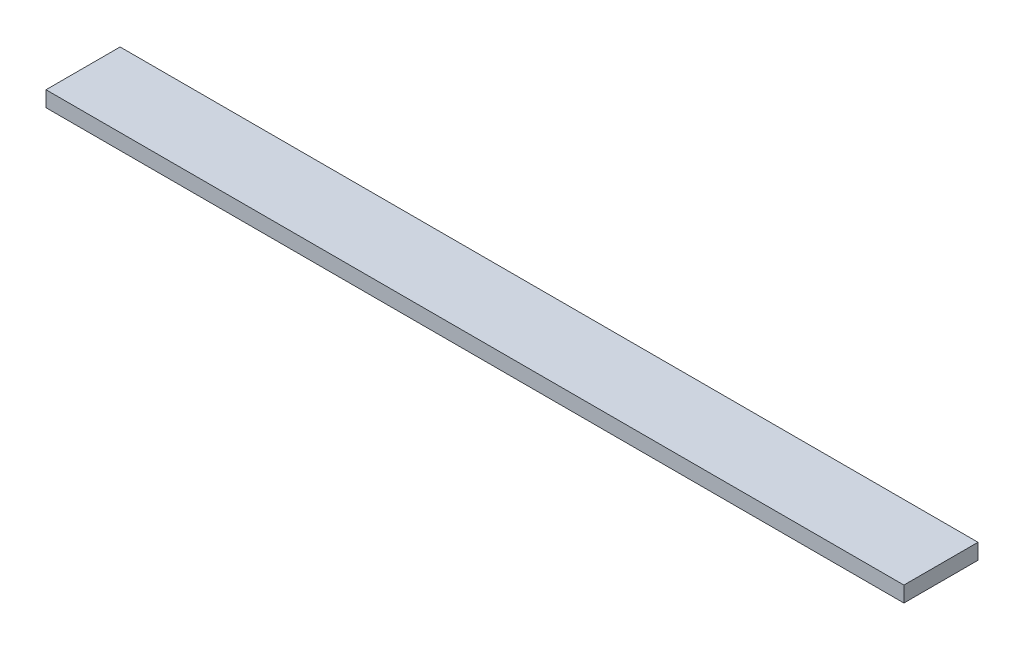
ISO-10303-21;
HEADER;
FILE_DESCRIPTION(('STEP AP214'),'2;1');
FILE_NAME('part.step','',(''),(''),'','','');
FILE_SCHEMA(('AUTOMOTIVE_DESIGN { 1 0 10303 214 1 1 1 1 }'));
ENDSEC;
DATA;
#1=APPLICATION_CONTEXT('core data for automotive mechanical design processes');
#2=APPLICATION_PROTOCOL_DEFINITION('international standard','automotive_design',2000,#1);
#3=PRODUCT_CONTEXT('',#1,'mechanical');
#4=PRODUCT('Part','Part','',(#3));
#5=PRODUCT_RELATED_PRODUCT_CATEGORY('part','',(#4));
#6=PRODUCT_DEFINITION_FORMATION('','',#4);
#7=PRODUCT_DEFINITION_CONTEXT('part definition',#1,'design');
#8=PRODUCT_DEFINITION('design','',#6,#7);
#9=PRODUCT_DEFINITION_SHAPE('','',#8);
#10=(LENGTH_UNIT() NAMED_UNIT(*) SI_UNIT(.MILLI.,.METRE.));
#11=(NAMED_UNIT(*) PLANE_ANGLE_UNIT() SI_UNIT($,.RADIAN.));
#12=(NAMED_UNIT(*) SI_UNIT($,.STERADIAN.) SOLID_ANGLE_UNIT());
#13=UNCERTAINTY_MEASURE_WITH_UNIT(LENGTH_MEASURE(1.E-05),#10,'distance_accuracy_value','');
#14=(GEOMETRIC_REPRESENTATION_CONTEXT(3) GLOBAL_UNCERTAINTY_ASSIGNED_CONTEXT((#13)) GLOBAL_UNIT_ASSIGNED_CONTEXT((#10,
#11,#12)) REPRESENTATION_CONTEXT('',''));
#15=CARTESIAN_POINT('',(0.,0.,0.));
#16=DIRECTION('',(0.,0.,1.));
#17=DIRECTION('',(1.,0.,0.));
#18=AXIS2_PLACEMENT_3D('',#15,#16,#17);
#19=CARTESIAN_POINT('',(0.,2.54,0.));
#20=DIRECTION('',(1.,0.,0.));
#21=DIRECTION('',(0.,0.,-1.));
#22=AXIS2_PLACEMENT_3D('',#19,#20,#21);
#23=PLANE('',#22);
#24=DIRECTION('',(0.,0.,1.));
#25=VECTOR('',#24,1.);
#26=CARTESIAN_POINT('',(0.,0.,0.));
#27=LINE('',#26,#25);
#28=CARTESIAN_POINT('',(0.,0.,-12.065));
#29=VERTEX_POINT('',#28);
#30=CARTESIAN_POINT('',(0.,0.,0.));
#31=VERTEX_POINT('',#30);
#32=EDGE_CURVE('E107',#29,#31,#27,.T.);
#33=ORIENTED_EDGE('',*,*,#32,.T.);
#34=DIRECTION('',(0.,-1.,0.));
#35=VECTOR('',#34,1.);
#36=CARTESIAN_POINT('',(0.,2.54,0.));
#37=LINE('',#36,#35);
#38=CARTESIAN_POINT('',(0.,2.54,0.));
#39=VERTEX_POINT('',#38);
#40=EDGE_CURVE('E11',#39,#31,#37,.T.);
#41=ORIENTED_EDGE('',*,*,#40,.F.);
#42=DIRECTION('',(0.,0.,1.));
#43=VECTOR('',#42,1.);
#44=CARTESIAN_POINT('',(0.,2.54,0.));
#45=LINE('',#44,#43);
#46=CARTESIAN_POINT('',(0.,2.54,-12.065));
#47=VERTEX_POINT('',#46);
#48=EDGE_CURVE('E91',#47,#39,#45,.T.);
#49=ORIENTED_EDGE('',*,*,#48,.F.);
#50=DIRECTION('',(0.,-1.,0.));
#51=VECTOR('',#50,1.);
#52=CARTESIAN_POINT('',(0.,2.54,-12.065));
#53=LINE('',#52,#51);
#54=EDGE_CURVE('E103',#47,#29,#53,.T.);
#55=ORIENTED_EDGE('',*,*,#54,.T.);
#56=EDGE_LOOP('',(#33,#41,#49,#55));
#57=FACE_BOUND('',#56,.T.);
#58=ADVANCED_FACE('F39',(#57),#23,.F.);
#59=CARTESIAN_POINT('',(0.,2.54,0.));
#60=DIRECTION('',(0.,0.,-1.));
#61=DIRECTION('',(-1.,0.,0.));
#62=AXIS2_PLACEMENT_3D('',#59,#60,#61);
#63=PLANE('',#62);
#64=DIRECTION('',(1.,0.,0.));
#65=VECTOR('',#64,1.);
#66=CARTESIAN_POINT('',(0.,0.,0.));
#67=LINE('',#66,#65);
#68=CARTESIAN_POINT('',(139.7,0.,0.));
#69=VERTEX_POINT('',#68);
#70=EDGE_CURVE('E96',#31,#69,#67,.T.);
#71=ORIENTED_EDGE('',*,*,#70,.T.);
#72=DIRECTION('',(0.,-1.,0.));
#73=VECTOR('',#72,1.);
#74=CARTESIAN_POINT('',(139.7,2.54,0.));
#75=LINE('',#74,#73);
#76=CARTESIAN_POINT('',(139.7,2.54,0.));
#77=VERTEX_POINT('',#76);
#78=EDGE_CURVE('E48',#77,#69,#75,.T.);
#79=ORIENTED_EDGE('',*,*,#78,.F.);
#80=DIRECTION('',(1.,0.,0.));
#81=VECTOR('',#80,1.);
#82=CARTESIAN_POINT('',(0.,2.54,0.));
#83=LINE('',#82,#81);
#84=EDGE_CURVE('E86',#39,#77,#83,.T.);
#85=ORIENTED_EDGE('',*,*,#84,.F.);
#86=ORIENTED_EDGE('',*,*,#40,.T.);
#87=EDGE_LOOP('',(#71,#79,#85,#86));
#88=FACE_BOUND('',#87,.T.);
#89=ADVANCED_FACE('F95',(#88),#63,.F.);
#90=CARTESIAN_POINT('',(139.7,2.54,0.));
#91=DIRECTION('',(-1.,0.,0.));
#92=DIRECTION('',(0.,0.,1.));
#93=AXIS2_PLACEMENT_3D('',#90,#91,#92);
#94=PLANE('',#93);
#95=DIRECTION('',(0.,0.,-1.));
#96=VECTOR('',#95,1.);
#97=CARTESIAN_POINT('',(139.7,0.,0.));
#98=LINE('',#97,#96);
#99=CARTESIAN_POINT('',(139.7,0.,-12.065));
#100=VERTEX_POINT('',#99);
#101=EDGE_CURVE('E73',#69,#100,#98,.T.);
#102=ORIENTED_EDGE('',*,*,#101,.T.);
#103=DIRECTION('',(0.,-1.,0.));
#104=VECTOR('',#103,1.);
#105=CARTESIAN_POINT('',(139.7,2.54,-12.065));
#106=LINE('',#105,#104);
#107=CARTESIAN_POINT('',(139.7,2.54,-12.065));
#108=VERTEX_POINT('',#107);
#109=EDGE_CURVE('E98',#108,#100,#106,.T.);
#110=ORIENTED_EDGE('',*,*,#109,.F.);
#111=DIRECTION('',(0.,0.,-1.));
#112=VECTOR('',#111,1.);
#113=CARTESIAN_POINT('',(139.7,2.54,0.));
#114=LINE('',#113,#112);
#115=EDGE_CURVE('E89',#77,#108,#114,.T.);
#116=ORIENTED_EDGE('',*,*,#115,.F.);
#117=ORIENTED_EDGE('',*,*,#78,.T.);
#118=EDGE_LOOP('',(#102,#110,#116,#117));
#119=FACE_BOUND('',#118,.T.);
#120=ADVANCED_FACE('F99',(#119),#94,.F.);
#121=CARTESIAN_POINT('',(0.,2.54,-12.065));
#122=DIRECTION('',(0.,0.,1.));
#123=DIRECTION('',(1.,0.,0.));
#124=AXIS2_PLACEMENT_3D('',#121,#122,#123);
#125=PLANE('',#124);
#126=DIRECTION('',(-1.,0.,0.));
#127=VECTOR('',#126,1.);
#128=CARTESIAN_POINT('',(0.,0.,-12.065));
#129=LINE('',#128,#127);
#130=EDGE_CURVE('E79',#100,#29,#129,.T.);
#131=ORIENTED_EDGE('',*,*,#130,.T.);
#132=ORIENTED_EDGE('',*,*,#54,.F.);
#133=DIRECTION('',(-1.,0.,0.));
#134=VECTOR('',#133,1.);
#135=CARTESIAN_POINT('',(0.,2.54,-12.065));
#136=LINE('',#135,#134);
#137=EDGE_CURVE('E56',#108,#47,#136,.T.);
#138=ORIENTED_EDGE('',*,*,#137,.F.);
#139=ORIENTED_EDGE('',*,*,#109,.T.);
#140=EDGE_LOOP('',(#131,#132,#138,#139));
#141=FACE_BOUND('',#140,.T.);
#142=ADVANCED_FACE('F120',(#141),#125,.F.);
#143=CARTESIAN_POINT('',(0.,2.54,0.));
#144=DIRECTION('',(0.,-1.,0.));
#145=DIRECTION('',(0.,0.,-1.));
#146=AXIS2_PLACEMENT_3D('',#143,#144,#145);
#147=PLANE('',#146);
#148=ORIENTED_EDGE('',*,*,#48,.T.);
#149=ORIENTED_EDGE('',*,*,#84,.T.);
#150=ORIENTED_EDGE('',*,*,#115,.T.);
#151=ORIENTED_EDGE('',*,*,#137,.T.);
#152=EDGE_LOOP('',(#148,#149,#150,#151));
#153=FACE_BOUND('',#152,.T.);
#154=ADVANCED_FACE('F87',(#153),#147,.F.);
#155=CARTESIAN_POINT('',(0.,0.,0.));
#156=DIRECTION('',(0.,-1.,0.));
#157=DIRECTION('',(0.,0.,-1.));
#158=AXIS2_PLACEMENT_3D('',#155,#156,#157);
#159=PLANE('',#158);
#160=ORIENTED_EDGE('',*,*,#32,.F.);
#161=ORIENTED_EDGE('',*,*,#130,.F.);
#162=ORIENTED_EDGE('',*,*,#101,.F.);
#163=ORIENTED_EDGE('',*,*,#70,.F.);
#164=EDGE_LOOP('',(#160,#161,#162,#163));
#165=FACE_BOUND('',#164,.T.);
#166=ADVANCED_FACE('F123',(#165),#159,.T.);
#167=CLOSED_SHELL('',(#58,#89,#120,#142,#154,#166));
#168=MANIFOLD_SOLID_BREP('B2',#167);
#169=ADVANCED_BREP_SHAPE_REPRESENTATION('',(#18,#168),#14);
#170=SHAPE_DEFINITION_REPRESENTATION(#9,#169);
ENDSEC;
END-ISO-10303-21;
